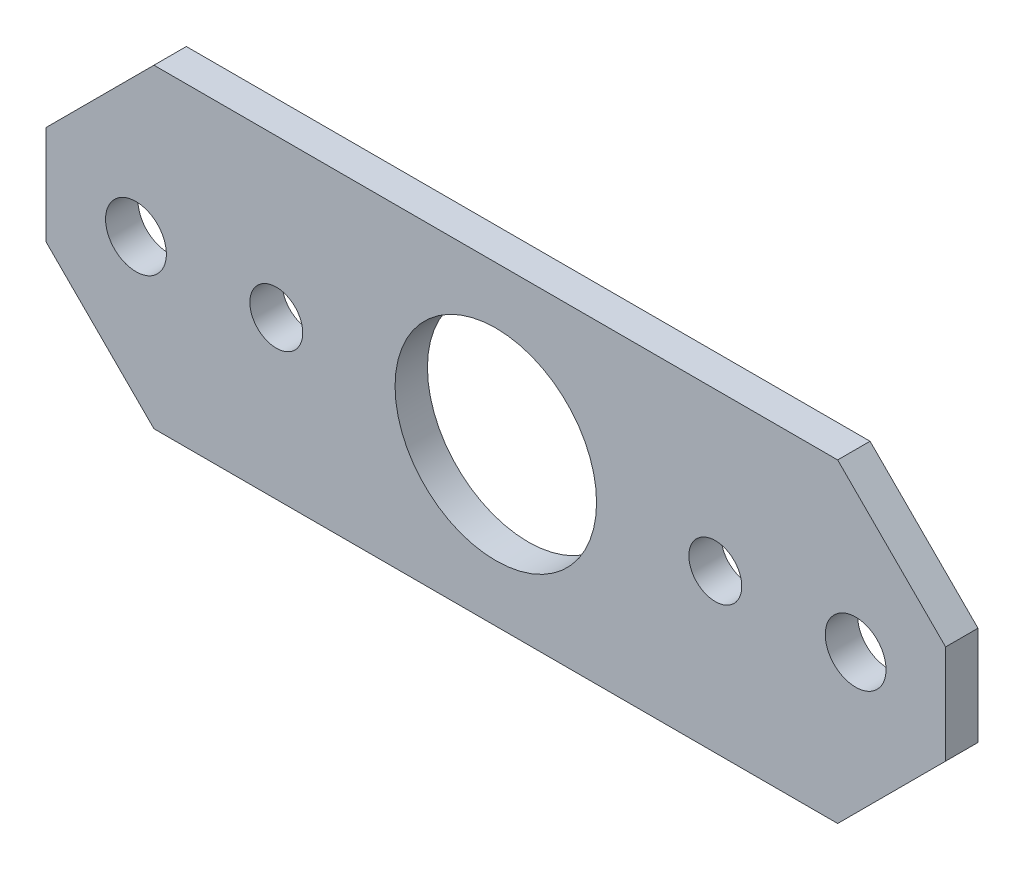
ISO-10303-21;
HEADER;
FILE_DESCRIPTION(('STEP AP214'),'2;1');
FILE_NAME('part.step','',(''),(''),'','','');
FILE_SCHEMA(('AUTOMOTIVE_DESIGN { 1 0 10303 214 1 1 1 1 }'));
ENDSEC;
DATA;
#1=APPLICATION_CONTEXT('core data for automotive mechanical design processes');
#2=APPLICATION_PROTOCOL_DEFINITION('international standard','automotive_design',2000,#1);
#3=PRODUCT_CONTEXT('',#1,'mechanical');
#4=PRODUCT('Part','Part','',(#3));
#5=PRODUCT_RELATED_PRODUCT_CATEGORY('part','',(#4));
#6=PRODUCT_DEFINITION_FORMATION('','',#4);
#7=PRODUCT_DEFINITION_CONTEXT('part definition',#1,'design');
#8=PRODUCT_DEFINITION('design','',#6,#7);
#9=PRODUCT_DEFINITION_SHAPE('','',#8);
#10=(LENGTH_UNIT() NAMED_UNIT(*) SI_UNIT(.MILLI.,.METRE.));
#11=(NAMED_UNIT(*) PLANE_ANGLE_UNIT() SI_UNIT($,.RADIAN.));
#12=(NAMED_UNIT(*) SI_UNIT($,.STERADIAN.) SOLID_ANGLE_UNIT());
#13=UNCERTAINTY_MEASURE_WITH_UNIT(LENGTH_MEASURE(1.E-05),#10,'distance_accuracy_value','');
#14=(GEOMETRIC_REPRESENTATION_CONTEXT(3) GLOBAL_UNCERTAINTY_ASSIGNED_CONTEXT((#13)) GLOBAL_UNIT_ASSIGNED_CONTEXT((#10,
#11,#12)) REPRESENTATION_CONTEXT('',''));
#15=CARTESIAN_POINT('',(0.,0.,0.));
#16=DIRECTION('',(0.,0.,1.));
#17=DIRECTION('',(1.,0.,0.));
#18=AXIS2_PLACEMENT_3D('',#15,#16,#17);
#19=CARTESIAN_POINT('',(-31.75,-11.1125,2.286));
#20=DIRECTION('',(0.,0.,1.));
#21=DIRECTION('',(1.,0.,0.));
#22=AXIS2_PLACEMENT_3D('',#19,#20,#21);
#23=PLANE('',#22);
#24=DIRECTION('',(1.,0.,0.));
#25=VECTOR('',#24,1.);
#26=CARTESIAN_POINT('',(-31.75,11.1125,2.286));
#27=LINE('',#26,#25);
#28=CARTESIAN_POINT('',(24.13,11.1125,2.286));
#29=VERTEX_POINT('',#28);
#30=CARTESIAN_POINT('',(-24.13,11.1125,2.286));
#31=VERTEX_POINT('',#30);
#32=EDGE_CURVE('E342',#29,#31,#27,.F.);
#33=ORIENTED_EDGE('',*,*,#32,.T.);
#34=DIRECTION('',(0.707106781186547,0.707106781186548,0.));
#35=VECTOR('',#34,1.);
#36=CARTESIAN_POINT('',(-31.75,3.4925,2.286));
#37=LINE('',#36,#35);
#38=CARTESIAN_POINT('',(-31.75,3.4925,2.286));
#39=VERTEX_POINT('',#38);
#40=EDGE_CURVE('E337',#31,#39,#37,.F.);
#41=ORIENTED_EDGE('',*,*,#40,.T.);
#42=DIRECTION('',(0.,1.,0.));
#43=VECTOR('',#42,1.);
#44=CARTESIAN_POINT('',(-31.75,11.1125,2.286));
#45=LINE('',#44,#43);
#46=CARTESIAN_POINT('',(-31.75,-3.4925,2.286));
#47=VERTEX_POINT('',#46);
#48=EDGE_CURVE('E332',#39,#47,#45,.F.);
#49=ORIENTED_EDGE('',*,*,#48,.T.);
#50=DIRECTION('',(-0.707106781186548,0.707106781186548,0.));
#51=VECTOR('',#50,1.);
#52=CARTESIAN_POINT('',(-24.13,-11.1125,2.286));
#53=LINE('',#52,#51);
#54=CARTESIAN_POINT('',(-24.13,-11.1125,2.286));
#55=VERTEX_POINT('',#54);
#56=EDGE_CURVE('E327',#47,#55,#53,.F.);
#57=ORIENTED_EDGE('',*,*,#56,.T.);
#58=DIRECTION('',(1.,0.,0.));
#59=VECTOR('',#58,1.);
#60=CARTESIAN_POINT('',(-31.75,-11.1125,2.286));
#61=LINE('',#60,#59);
#62=CARTESIAN_POINT('',(24.13,-11.1125,2.286));
#63=VERTEX_POINT('',#62);
#64=EDGE_CURVE('E83',#55,#63,#61,.T.);
#65=ORIENTED_EDGE('',*,*,#64,.T.);
#66=DIRECTION('',(-0.707106781186548,-0.707106781186547,0.));
#67=VECTOR('',#66,1.);
#68=CARTESIAN_POINT('',(31.75,-3.4925,2.286));
#69=LINE('',#68,#67);
#70=CARTESIAN_POINT('',(31.75,-3.4925,2.286));
#71=VERTEX_POINT('',#70);
#72=EDGE_CURVE('E81',#63,#71,#69,.F.);
#73=ORIENTED_EDGE('',*,*,#72,.T.);
#74=DIRECTION('',(0.,1.,0.));
#75=VECTOR('',#74,1.);
#76=CARTESIAN_POINT('',(31.75,11.1125,2.286));
#77=LINE('',#76,#75);
#78=CARTESIAN_POINT('',(31.75,3.4925,2.286));
#79=VERTEX_POINT('',#78);
#80=EDGE_CURVE('E78',#71,#79,#77,.T.);
#81=ORIENTED_EDGE('',*,*,#80,.T.);
#82=DIRECTION('',(0.707106781186548,-0.707106781186547,0.));
#83=VECTOR('',#82,1.);
#84=CARTESIAN_POINT('',(24.13,11.1125,2.286));
#85=LINE('',#84,#83);
#86=EDGE_CURVE('E312',#79,#29,#85,.F.);
#87=ORIENTED_EDGE('',*,*,#86,.T.);
#88=EDGE_LOOP('',(#33,#41,#49,#57,#65,#73,#81,#87));
#89=FACE_BOUND('',#88,.T.);
#90=CARTESIAN_POINT('',(0.,0.,2.286));
#91=DIRECTION('',(0.,0.,-1.));
#92=DIRECTION('',(-1.,0.,0.));
#93=AXIS2_PLACEMENT_3D('',#90,#91,#92);
#94=CIRCLE('',#93,7.112);
#95=CARTESIAN_POINT('',(-7.112,0.,2.286));
#96=VERTEX_POINT('',#95);
#97=EDGE_CURVE('E89',#96,#96,#94,.T.);
#98=ORIENTED_EDGE('',*,*,#97,.T.);
#99=EDGE_LOOP('',(#98));
#100=FACE_BOUND('',#99,.T.);
#101=CARTESIAN_POINT('',(25.4,0.,2.286));
#102=DIRECTION('',(0.,0.,-1.));
#103=DIRECTION('',(-1.,0.,0.));
#104=AXIS2_PLACEMENT_3D('',#101,#102,#103);
#105=CIRCLE('',#104,2.1463);
#106=CARTESIAN_POINT('',(23.2537,0.,2.286));
#107=VERTEX_POINT('',#106);
#108=EDGE_CURVE('E121',#107,#107,#105,.T.);
#109=ORIENTED_EDGE('',*,*,#108,.T.);
#110=EDGE_LOOP('',(#109));
#111=FACE_BOUND('',#110,.T.);
#112=CARTESIAN_POINT('',(-25.4,0.,2.286));
#113=DIRECTION('',(0.,0.,-1.));
#114=DIRECTION('',(-1.,0.,0.));
#115=AXIS2_PLACEMENT_3D('',#112,#113,#114);
#116=CIRCLE('',#115,2.1463);
#117=CARTESIAN_POINT('',(-27.5463,0.,2.286));
#118=VERTEX_POINT('',#117);
#119=EDGE_CURVE('E124',#118,#118,#116,.T.);
#120=ORIENTED_EDGE('',*,*,#119,.T.);
#121=EDGE_LOOP('',(#120));
#122=FACE_BOUND('',#121,.T.);
#123=CARTESIAN_POINT('',(15.494,0.,2.286));
#124=DIRECTION('',(0.,0.,-1.));
#125=DIRECTION('',(-1.,0.,0.));
#126=AXIS2_PLACEMENT_3D('',#123,#124,#125);
#127=CIRCLE('',#126,1.8669);
#128=CARTESIAN_POINT('',(13.6271,0.,2.286));
#129=VERTEX_POINT('',#128);
#130=EDGE_CURVE('E126',#129,#129,#127,.T.);
#131=ORIENTED_EDGE('',*,*,#130,.T.);
#132=EDGE_LOOP('',(#131));
#133=FACE_BOUND('',#132,.T.);
#134=CARTESIAN_POINT('',(-15.494,0.,2.286));
#135=DIRECTION('',(0.,0.,-1.));
#136=DIRECTION('',(-1.,0.,0.));
#137=AXIS2_PLACEMENT_3D('',#134,#135,#136);
#138=CIRCLE('',#137,1.8669);
#139=CARTESIAN_POINT('',(-17.3609,0.,2.286));
#140=VERTEX_POINT('',#139);
#141=EDGE_CURVE('E19',#140,#140,#138,.T.);
#142=ORIENTED_EDGE('',*,*,#141,.T.);
#143=EDGE_LOOP('',(#142));
#144=FACE_BOUND('',#143,.T.);
#145=ADVANCED_FACE('F16',(#89,#100,#111,#122,#133,#144),#23,.T.);
#146=CARTESIAN_POINT('',(-15.494,0.,2.286));
#147=DIRECTION('',(0.,0.,-1.));
#148=DIRECTION('',(-1.,0.,0.));
#149=AXIS2_PLACEMENT_3D('',#146,#147,#148);
#150=CYLINDRICAL_SURFACE('',#149,1.8669);
#151=ORIENTED_EDGE('',*,*,#141,.F.);
#152=EDGE_LOOP('',(#151));
#153=FACE_BOUND('',#152,.T.);
#154=CARTESIAN_POINT('',(-15.494,0.,0.));
#155=DIRECTION('',(0.,0.,-1.));
#156=DIRECTION('',(-1.,0.,0.));
#157=AXIS2_PLACEMENT_3D('',#154,#155,#156);
#158=CIRCLE('',#157,1.8669);
#159=CARTESIAN_POINT('',(-17.3609,0.,0.));
#160=VERTEX_POINT('',#159);
#161=EDGE_CURVE('E116',#160,#160,#158,.T.);
#162=ORIENTED_EDGE('',*,*,#161,.T.);
#163=EDGE_LOOP('',(#162));
#164=FACE_BOUND('',#163,.T.);
#165=ADVANCED_FACE('F134',(#153,#164),#150,.F.);
#166=CARTESIAN_POINT('',(15.494,0.,2.286));
#167=DIRECTION('',(0.,0.,-1.));
#168=DIRECTION('',(-1.,0.,0.));
#169=AXIS2_PLACEMENT_3D('',#166,#167,#168);
#170=CYLINDRICAL_SURFACE('',#169,1.8669);
#171=ORIENTED_EDGE('',*,*,#130,.F.);
#172=EDGE_LOOP('',(#171));
#173=FACE_BOUND('',#172,.T.);
#174=CARTESIAN_POINT('',(15.494,0.,0.));
#175=DIRECTION('',(0.,0.,-1.));
#176=DIRECTION('',(-1.,0.,0.));
#177=AXIS2_PLACEMENT_3D('',#174,#175,#176);
#178=CIRCLE('',#177,1.8669);
#179=CARTESIAN_POINT('',(13.6271,0.,0.));
#180=VERTEX_POINT('',#179);
#181=EDGE_CURVE('E113',#180,#180,#178,.T.);
#182=ORIENTED_EDGE('',*,*,#181,.T.);
#183=EDGE_LOOP('',(#182));
#184=FACE_BOUND('',#183,.T.);
#185=ADVANCED_FACE('F137',(#173,#184),#170,.F.);
#186=CARTESIAN_POINT('',(-25.4,0.,2.286));
#187=DIRECTION('',(0.,0.,-1.));
#188=DIRECTION('',(-1.,0.,0.));
#189=AXIS2_PLACEMENT_3D('',#186,#187,#188);
#190=CYLINDRICAL_SURFACE('',#189,2.1463);
#191=ORIENTED_EDGE('',*,*,#119,.F.);
#192=EDGE_LOOP('',(#191));
#193=FACE_BOUND('',#192,.T.);
#194=CARTESIAN_POINT('',(-25.4,0.,0.));
#195=DIRECTION('',(0.,0.,-1.));
#196=DIRECTION('',(-1.,0.,0.));
#197=AXIS2_PLACEMENT_3D('',#194,#195,#196);
#198=CIRCLE('',#197,2.1463);
#199=CARTESIAN_POINT('',(-27.5463,0.,0.));
#200=VERTEX_POINT('',#199);
#201=EDGE_CURVE('E110',#200,#200,#198,.T.);
#202=ORIENTED_EDGE('',*,*,#201,.T.);
#203=EDGE_LOOP('',(#202));
#204=FACE_BOUND('',#203,.T.);
#205=ADVANCED_FACE('F184',(#193,#204),#190,.F.);
#206=CARTESIAN_POINT('',(25.4,0.,2.286));
#207=DIRECTION('',(0.,0.,-1.));
#208=DIRECTION('',(-1.,0.,0.));
#209=AXIS2_PLACEMENT_3D('',#206,#207,#208);
#210=CYLINDRICAL_SURFACE('',#209,2.1463);
#211=ORIENTED_EDGE('',*,*,#108,.F.);
#212=EDGE_LOOP('',(#211));
#213=FACE_BOUND('',#212,.T.);
#214=CARTESIAN_POINT('',(25.4,0.,0.));
#215=DIRECTION('',(0.,0.,-1.));
#216=DIRECTION('',(-1.,0.,0.));
#217=AXIS2_PLACEMENT_3D('',#214,#215,#216);
#218=CIRCLE('',#217,2.1463);
#219=CARTESIAN_POINT('',(23.2537,0.,0.));
#220=VERTEX_POINT('',#219);
#221=EDGE_CURVE('E107',#220,#220,#218,.T.);
#222=ORIENTED_EDGE('',*,*,#221,.T.);
#223=EDGE_LOOP('',(#222));
#224=FACE_BOUND('',#223,.T.);
#225=ADVANCED_FACE('F180',(#213,#224),#210,.F.);
#226=CARTESIAN_POINT('',(0.,0.,2.286));
#227=DIRECTION('',(0.,0.,-1.));
#228=DIRECTION('',(-1.,0.,0.));
#229=AXIS2_PLACEMENT_3D('',#226,#227,#228);
#230=CYLINDRICAL_SURFACE('',#229,7.112);
#231=ORIENTED_EDGE('',*,*,#97,.F.);
#232=EDGE_LOOP('',(#231));
#233=FACE_BOUND('',#232,.T.);
#234=CARTESIAN_POINT('',(0.,0.,0.));
#235=DIRECTION('',(0.,0.,-1.));
#236=DIRECTION('',(-1.,0.,0.));
#237=AXIS2_PLACEMENT_3D('',#234,#235,#236);
#238=CIRCLE('',#237,7.112);
#239=CARTESIAN_POINT('',(-7.112,0.,0.));
#240=VERTEX_POINT('',#239);
#241=EDGE_CURVE('E104',#240,#240,#238,.T.);
#242=ORIENTED_EDGE('',*,*,#241,.T.);
#243=EDGE_LOOP('',(#242));
#244=FACE_BOUND('',#243,.T.);
#245=ADVANCED_FACE('F177',(#233,#244),#230,.F.);
#246=CARTESIAN_POINT('',(31.75,-3.4925,2.286));
#247=DIRECTION('',(-0.707106781186547,0.707106781186548,0.));
#248=DIRECTION('',(-0.707106781186548,-0.707106781186547,0.));
#249=AXIS2_PLACEMENT_3D('',#246,#247,#248);
#250=PLANE('',#249);
#251=DIRECTION('',(0.,0.,1.));
#252=VECTOR('',#251,1.);
#253=CARTESIAN_POINT('',(24.13,-11.1125,2.286));
#254=LINE('',#253,#252);
#255=CARTESIAN_POINT('',(24.13,-11.1125,0.));
#256=VERTEX_POINT('',#255);
#257=EDGE_CURVE('E325',#63,#256,#254,.F.);
#258=ORIENTED_EDGE('',*,*,#257,.T.);
#259=DIRECTION('',(0.707106781186548,0.707106781186547,0.));
#260=VECTOR('',#259,1.);
#261=CARTESIAN_POINT('',(24.13,-11.1125,0.));
#262=LINE('',#261,#260);
#263=CARTESIAN_POINT('',(31.75,-3.4925,0.));
#264=VERTEX_POINT('',#263);
#265=EDGE_CURVE('E100',#256,#264,#262,.T.);
#266=ORIENTED_EDGE('',*,*,#265,.T.);
#267=DIRECTION('',(0.,0.,1.));
#268=VECTOR('',#267,1.);
#269=CARTESIAN_POINT('',(31.75,-3.4925,2.286));
#270=LINE('',#269,#268);
#271=EDGE_CURVE('E88',#264,#71,#270,.T.);
#272=ORIENTED_EDGE('',*,*,#271,.T.);
#273=ORIENTED_EDGE('',*,*,#72,.F.);
#274=EDGE_LOOP('',(#258,#266,#272,#273));
#275=FACE_BOUND('',#274,.T.);
#276=ADVANCED_FACE('F99',(#275),#250,.F.);
#277=CARTESIAN_POINT('',(31.75,11.1125,2.286));
#278=DIRECTION('',(-1.,0.,0.));
#279=DIRECTION('',(0.,0.,1.));
#280=AXIS2_PLACEMENT_3D('',#277,#278,#279);
#281=PLANE('',#280);
#282=ORIENTED_EDGE('',*,*,#271,.F.);
#283=DIRECTION('',(0.,1.,0.));
#284=VECTOR('',#283,1.);
#285=CARTESIAN_POINT('',(31.75,-11.1125,0.));
#286=LINE('',#285,#284);
#287=CARTESIAN_POINT('',(31.75,3.4925,0.));
#288=VERTEX_POINT('',#287);
#289=EDGE_CURVE('E314',#264,#288,#286,.T.);
#290=ORIENTED_EDGE('',*,*,#289,.T.);
#291=DIRECTION('',(0.,0.,1.));
#292=VECTOR('',#291,1.);
#293=CARTESIAN_POINT('',(31.75,3.4925,2.286));
#294=LINE('',#293,#292);
#295=EDGE_CURVE('E96',#288,#79,#294,.T.);
#296=ORIENTED_EDGE('',*,*,#295,.T.);
#297=ORIENTED_EDGE('',*,*,#80,.F.);
#298=EDGE_LOOP('',(#282,#290,#296,#297));
#299=FACE_BOUND('',#298,.T.);
#300=ADVANCED_FACE('F93',(#299),#281,.F.);
#301=CARTESIAN_POINT('',(24.13,11.1125,2.286));
#302=DIRECTION('',(-0.707106781186547,-0.707106781186548,0.));
#303=DIRECTION('',(0.707106781186548,-0.707106781186547,0.));
#304=AXIS2_PLACEMENT_3D('',#301,#302,#303);
#305=PLANE('',#304);
#306=ORIENTED_EDGE('',*,*,#295,.F.);
#307=DIRECTION('',(-0.707106781186548,0.707106781186547,0.));
#308=VECTOR('',#307,1.);
#309=CARTESIAN_POINT('',(31.75,3.4925,0.));
#310=LINE('',#309,#308);
#311=CARTESIAN_POINT('',(24.13,11.1125,0.));
#312=VERTEX_POINT('',#311);
#313=EDGE_CURVE('E311',#288,#312,#310,.T.);
#314=ORIENTED_EDGE('',*,*,#313,.T.);
#315=DIRECTION('',(0.,0.,-1.));
#316=VECTOR('',#315,1.);
#317=CARTESIAN_POINT('',(24.13,11.1125,2.286));
#318=LINE('',#317,#316);
#319=EDGE_CURVE('E344',#312,#29,#318,.F.);
#320=ORIENTED_EDGE('',*,*,#319,.T.);
#321=ORIENTED_EDGE('',*,*,#86,.F.);
#322=EDGE_LOOP('',(#306,#314,#320,#321));
#323=FACE_BOUND('',#322,.T.);
#324=ADVANCED_FACE('F168',(#323),#305,.F.);
#325=CARTESIAN_POINT('',(-31.75,11.1125,2.286));
#326=DIRECTION('',(0.,-1.,0.));
#327=DIRECTION('',(0.,0.,-1.));
#328=AXIS2_PLACEMENT_3D('',#325,#326,#327);
#329=PLANE('',#328);
#330=ORIENTED_EDGE('',*,*,#319,.F.);
#331=DIRECTION('',(1.,0.,0.));
#332=VECTOR('',#331,1.);
#333=CARTESIAN_POINT('',(-31.75,11.1125,0.));
#334=LINE('',#333,#332);
#335=CARTESIAN_POINT('',(-24.13,11.1125,0.));
#336=VERTEX_POINT('',#335);
#337=EDGE_CURVE('E317',#312,#336,#334,.F.);
#338=ORIENTED_EDGE('',*,*,#337,.T.);
#339=DIRECTION('',(0.,0.,1.));
#340=VECTOR('',#339,1.);
#341=CARTESIAN_POINT('',(-24.13,11.1125,2.286));
#342=LINE('',#341,#340);
#343=EDGE_CURVE('E339',#336,#31,#342,.T.);
#344=ORIENTED_EDGE('',*,*,#343,.T.);
#345=ORIENTED_EDGE('',*,*,#32,.F.);
#346=EDGE_LOOP('',(#330,#338,#344,#345));
#347=FACE_BOUND('',#346,.T.);
#348=ADVANCED_FACE('F164',(#347),#329,.F.);
#349=CARTESIAN_POINT('',(-31.75,3.4925,2.286));
#350=DIRECTION('',(0.707106781186548,-0.707106781186547,0.));
#351=DIRECTION('',(0.707106781186547,0.707106781186548,0.));
#352=AXIS2_PLACEMENT_3D('',#349,#350,#351);
#353=PLANE('',#352);
#354=ORIENTED_EDGE('',*,*,#343,.F.);
#355=DIRECTION('',(-0.707106781186547,-0.707106781186548,0.));
#356=VECTOR('',#355,1.);
#357=CARTESIAN_POINT('',(-24.13,11.1125,0.));
#358=LINE('',#357,#356);
#359=CARTESIAN_POINT('',(-31.75,3.4925,0.));
#360=VERTEX_POINT('',#359);
#361=EDGE_CURVE('E349',#336,#360,#358,.T.);
#362=ORIENTED_EDGE('',*,*,#361,.T.);
#363=DIRECTION('',(0.,0.,-1.));
#364=VECTOR('',#363,1.);
#365=CARTESIAN_POINT('',(-31.75,3.4925,2.286));
#366=LINE('',#365,#364);
#367=EDGE_CURVE('E334',#360,#39,#366,.F.);
#368=ORIENTED_EDGE('',*,*,#367,.T.);
#369=ORIENTED_EDGE('',*,*,#40,.F.);
#370=EDGE_LOOP('',(#354,#362,#368,#369));
#371=FACE_BOUND('',#370,.T.);
#372=ADVANCED_FACE('F160',(#371),#353,.F.);
#373=CARTESIAN_POINT('',(-31.75,11.1125,2.286));
#374=DIRECTION('',(1.,0.,0.));
#375=DIRECTION('',(0.,0.,-1.));
#376=AXIS2_PLACEMENT_3D('',#373,#374,#375);
#377=PLANE('',#376);
#378=DIRECTION('',(0.,0.,1.));
#379=VECTOR('',#378,1.);
#380=CARTESIAN_POINT('',(-31.75,-3.4925,2.286));
#381=LINE('',#380,#379);
#382=CARTESIAN_POINT('',(-31.75,-3.4925,0.));
#383=VERTEX_POINT('',#382);
#384=EDGE_CURVE('E329',#383,#47,#381,.T.);
#385=ORIENTED_EDGE('',*,*,#384,.T.);
#386=ORIENTED_EDGE('',*,*,#48,.F.);
#387=ORIENTED_EDGE('',*,*,#367,.F.);
#388=DIRECTION('',(0.,1.,0.));
#389=VECTOR('',#388,1.);
#390=CARTESIAN_POINT('',(-31.75,-11.1125,0.));
#391=LINE('',#390,#389);
#392=EDGE_CURVE('E352',#360,#383,#391,.F.);
#393=ORIENTED_EDGE('',*,*,#392,.T.);
#394=EDGE_LOOP('',(#385,#386,#387,#393));
#395=FACE_BOUND('',#394,.T.);
#396=ADVANCED_FACE('F156',(#395),#377,.F.);
#397=CARTESIAN_POINT('',(-24.13,-11.1125,2.286));
#398=DIRECTION('',(0.707106781186548,0.707106781186548,0.));
#399=DIRECTION('',(-0.707106781186548,0.707106781186548,0.));
#400=AXIS2_PLACEMENT_3D('',#397,#398,#399);
#401=PLANE('',#400);
#402=ORIENTED_EDGE('',*,*,#384,.F.);
#403=DIRECTION('',(0.707106781186547,-0.707106781186548,0.));
#404=VECTOR('',#403,1.);
#405=CARTESIAN_POINT('',(-31.75,-3.4925,0.));
#406=LINE('',#405,#404);
#407=CARTESIAN_POINT('',(-24.13,-11.1125,0.));
#408=VERTEX_POINT('',#407);
#409=EDGE_CURVE('E25',#383,#408,#406,.T.);
#410=ORIENTED_EDGE('',*,*,#409,.T.);
#411=DIRECTION('',(0.,0.,1.));
#412=VECTOR('',#411,1.);
#413=CARTESIAN_POINT('',(-24.13,-11.1125,2.286));
#414=LINE('',#413,#412);
#415=EDGE_CURVE('E33',#408,#55,#414,.T.);
#416=ORIENTED_EDGE('',*,*,#415,.T.);
#417=ORIENTED_EDGE('',*,*,#56,.F.);
#418=EDGE_LOOP('',(#402,#410,#416,#417));
#419=FACE_BOUND('',#418,.T.);
#420=ADVANCED_FACE('F149',(#419),#401,.F.);
#421=CARTESIAN_POINT('',(-31.75,-11.1125,2.286));
#422=DIRECTION('',(0.,1.,0.));
#423=DIRECTION('',(0.,0.,1.));
#424=AXIS2_PLACEMENT_3D('',#421,#422,#423);
#425=PLANE('',#424);
#426=ORIENTED_EDGE('',*,*,#415,.F.);
#427=DIRECTION('',(1.,0.,0.));
#428=VECTOR('',#427,1.);
#429=CARTESIAN_POINT('',(-31.75,-11.1125,0.));
#430=LINE('',#429,#428);
#431=EDGE_CURVE('E11',#408,#256,#430,.T.);
#432=ORIENTED_EDGE('',*,*,#431,.T.);
#433=ORIENTED_EDGE('',*,*,#257,.F.);
#434=ORIENTED_EDGE('',*,*,#64,.F.);
#435=EDGE_LOOP('',(#426,#432,#433,#434));
#436=FACE_BOUND('',#435,.T.);
#437=ADVANCED_FACE('F142',(#436),#425,.F.);
#438=CARTESIAN_POINT('',(-31.75,-11.1125,0.));
#439=DIRECTION('',(0.,0.,1.));
#440=DIRECTION('',(1.,0.,0.));
#441=AXIS2_PLACEMENT_3D('',#438,#439,#440);
#442=PLANE('',#441);
#443=ORIENTED_EDGE('',*,*,#409,.F.);
#444=ORIENTED_EDGE('',*,*,#392,.F.);
#445=ORIENTED_EDGE('',*,*,#361,.F.);
#446=ORIENTED_EDGE('',*,*,#337,.F.);
#447=ORIENTED_EDGE('',*,*,#313,.F.);
#448=ORIENTED_EDGE('',*,*,#289,.F.);
#449=ORIENTED_EDGE('',*,*,#265,.F.);
#450=ORIENTED_EDGE('',*,*,#431,.F.);
#451=EDGE_LOOP('',(#443,#444,#445,#446,#447,#448,#449,#450));
#452=FACE_BOUND('',#451,.T.);
#453=ORIENTED_EDGE('',*,*,#241,.F.);
#454=EDGE_LOOP('',(#453));
#455=FACE_BOUND('',#454,.T.);
#456=ORIENTED_EDGE('',*,*,#221,.F.);
#457=EDGE_LOOP('',(#456));
#458=FACE_BOUND('',#457,.T.);
#459=ORIENTED_EDGE('',*,*,#201,.F.);
#460=EDGE_LOOP('',(#459));
#461=FACE_BOUND('',#460,.T.);
#462=ORIENTED_EDGE('',*,*,#181,.F.);
#463=EDGE_LOOP('',(#462));
#464=FACE_BOUND('',#463,.T.);
#465=ORIENTED_EDGE('',*,*,#161,.F.);
#466=EDGE_LOOP('',(#465));
#467=FACE_BOUND('',#466,.T.);
#468=ADVANCED_FACE('F140',(#452,#455,#458,#461,#464,#467),#442,.F.);
#469=CLOSED_SHELL('',(#145,#165,#185,#205,#225,#245,#276,#300,#324,#348,#372,#396,#420,#437,#468));
#470=MANIFOLD_SOLID_BREP('B1',#469);
#471=ADVANCED_BREP_SHAPE_REPRESENTATION('',(#18,#470),#14);
#472=SHAPE_DEFINITION_REPRESENTATION(#9,#471);
ENDSEC;
END-ISO-10303-21;
